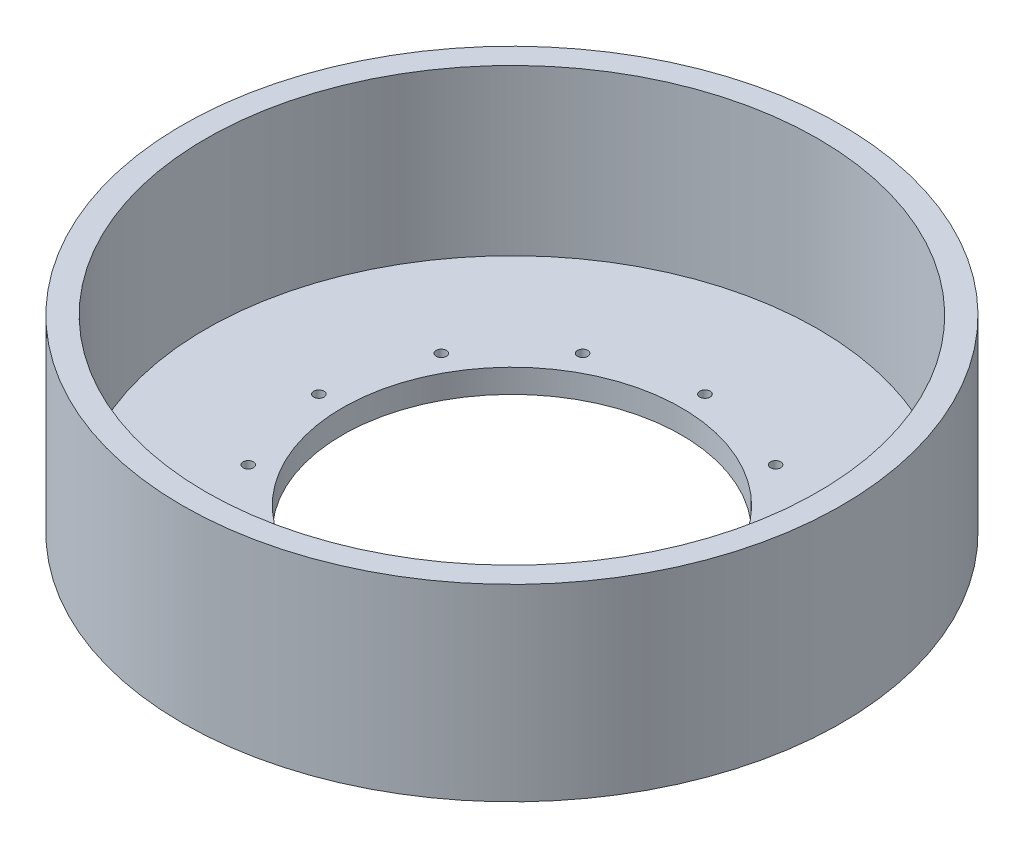
ISO-10303-21;
HEADER;
FILE_DESCRIPTION(('STEP AP214'),'2;1');
FILE_NAME('part.step','',(''),(''),'','','');
FILE_SCHEMA(('AUTOMOTIVE_DESIGN { 1 0 10303 214 1 1 1 1 }'));
ENDSEC;
DATA;
#1=APPLICATION_CONTEXT('core data for automotive mechanical design processes');
#2=APPLICATION_PROTOCOL_DEFINITION('international standard','automotive_design',2000,#1);
#3=PRODUCT_CONTEXT('',#1,'mechanical');
#4=PRODUCT('Part','Part','',(#3));
#5=PRODUCT_RELATED_PRODUCT_CATEGORY('part','',(#4));
#6=PRODUCT_DEFINITION_FORMATION('','',#4);
#7=PRODUCT_DEFINITION_CONTEXT('part definition',#1,'design');
#8=PRODUCT_DEFINITION('design','',#6,#7);
#9=PRODUCT_DEFINITION_SHAPE('','',#8);
#10=(LENGTH_UNIT() NAMED_UNIT(*) SI_UNIT(.MILLI.,.METRE.));
#11=(NAMED_UNIT(*) PLANE_ANGLE_UNIT() SI_UNIT($,.RADIAN.));
#12=(NAMED_UNIT(*) SI_UNIT($,.STERADIAN.) SOLID_ANGLE_UNIT());
#13=UNCERTAINTY_MEASURE_WITH_UNIT(LENGTH_MEASURE(1.E-05),#10,'distance_accuracy_value','');
#14=(GEOMETRIC_REPRESENTATION_CONTEXT(3) GLOBAL_UNCERTAINTY_ASSIGNED_CONTEXT((#13)) GLOBAL_UNIT_ASSIGNED_CONTEXT((#10,
#11,#12)) REPRESENTATION_CONTEXT('',''));
#15=CARTESIAN_POINT('',(0.,0.,0.));
#16=DIRECTION('',(0.,0.,1.));
#17=DIRECTION('',(1.,0.,0.));
#18=AXIS2_PLACEMENT_3D('',#15,#16,#17);
#19=CARTESIAN_POINT('',(0.,50.8,0.));
#20=DIRECTION('',(0.,-1.,0.));
#21=DIRECTION('',(0.,0.,-1.));
#22=AXIS2_PLACEMENT_3D('',#19,#20,#21);
#23=CYLINDRICAL_SURFACE('',#22,88.9);
#24=CARTESIAN_POINT('',(0.,50.8,0.));
#25=DIRECTION('',(0.,1.,0.));
#26=DIRECTION('',(0.,0.,1.));
#27=AXIS2_PLACEMENT_3D('',#24,#25,#26);
#28=CIRCLE('',#27,88.9);
#29=CARTESIAN_POINT('',(0.,50.8,88.9));
#30=VERTEX_POINT('',#29);
#31=EDGE_CURVE('E10',#30,#30,#28,.T.);
#32=ORIENTED_EDGE('',*,*,#31,.F.);
#33=EDGE_LOOP('',(#32));
#34=FACE_BOUND('',#33,.T.);
#35=CARTESIAN_POINT('',(0.,0.,0.));
#36=DIRECTION('',(0.,1.,0.));
#37=DIRECTION('',(0.,0.,1.));
#38=AXIS2_PLACEMENT_3D('',#35,#36,#37);
#39=CIRCLE('',#38,88.9);
#40=CARTESIAN_POINT('',(0.,0.,88.9));
#41=VERTEX_POINT('',#40);
#42=EDGE_CURVE('E34',#41,#41,#39,.T.);
#43=ORIENTED_EDGE('',*,*,#42,.T.);
#44=EDGE_LOOP('',(#43));
#45=FACE_BOUND('',#44,.T.);
#46=ADVANCED_FACE('F31',(#34,#45),#23,.T.);
#47=CARTESIAN_POINT('',(0.,50.8,0.));
#48=DIRECTION('',(0.,1.,0.));
#49=DIRECTION('',(0.,0.,1.));
#50=AXIS2_PLACEMENT_3D('',#47,#48,#49);
#51=PLANE('',#50);
#52=CARTESIAN_POINT('',(0.,50.8,0.));
#53=DIRECTION('',(0.,1.,0.));
#54=DIRECTION('',(0.,0.,1.));
#55=AXIS2_PLACEMENT_3D('',#52,#53,#54);
#56=CIRCLE('',#55,82.55);
#57=CARTESIAN_POINT('',(0.,50.8,82.55));
#58=VERTEX_POINT('',#57);
#59=EDGE_CURVE('E43',#58,#58,#56,.T.);
#60=ORIENTED_EDGE('',*,*,#59,.F.);
#61=EDGE_LOOP('',(#60));
#62=FACE_BOUND('',#61,.T.);
#63=ORIENTED_EDGE('',*,*,#31,.T.);
#64=EDGE_LOOP('',(#63));
#65=FACE_BOUND('',#64,.T.);
#66=ADVANCED_FACE('F158',(#62,#65),#51,.T.);
#67=CARTESIAN_POINT('',(0.,0.,0.));
#68=DIRECTION('',(0.,1.,0.));
#69=DIRECTION('',(0.,0.,1.));
#70=AXIS2_PLACEMENT_3D('',#67,#68,#69);
#71=PLANE('',#70);
#72=CARTESIAN_POINT('',(0.,0.,-52.07));
#73=DIRECTION('',(0.,1.,0.));
#74=DIRECTION('',(0.,0.,1.));
#75=AXIS2_PLACEMENT_3D('',#72,#73,#74);
#76=CIRCLE('',#75,1.397);
#77=CARTESIAN_POINT('',(0.,0.,-50.673));
#78=VERTEX_POINT('',#77);
#79=EDGE_CURVE('E52',#78,#78,#76,.T.);
#80=ORIENTED_EDGE('',*,*,#79,.T.);
#81=EDGE_LOOP('',(#80));
#82=FACE_BOUND('',#81,.T.);
#83=CARTESIAN_POINT('',(26.035,0.,-45.0939427750557));
#84=DIRECTION('',(0.,1.,0.));
#85=DIRECTION('',(0.,0.,1.));
#86=AXIS2_PLACEMENT_3D('',#83,#84,#85);
#87=CIRCLE('',#86,1.397);
#88=CARTESIAN_POINT('',(26.035,0.,-43.6969427750557));
#89=VERTEX_POINT('',#88);
#90=EDGE_CURVE('E95',#89,#89,#87,.T.);
#91=ORIENTED_EDGE('',*,*,#90,.T.);
#92=EDGE_LOOP('',(#91));
#93=FACE_BOUND('',#92,.T.);
#94=CARTESIAN_POINT('',(45.0939427750568,0.,-26.0350000000019));
#95=DIRECTION('',(0.,1.,0.));
#96=DIRECTION('',(0.,0.,1.));
#97=AXIS2_PLACEMENT_3D('',#94,#95,#96);
#98=CIRCLE('',#97,1.39700000000062);
#99=CARTESIAN_POINT('',(45.0939427750568,0.,-24.6380000000013));
#100=VERTEX_POINT('',#99);
#101=EDGE_CURVE('E89',#100,#100,#98,.T.);
#102=ORIENTED_EDGE('',*,*,#101,.T.);
#103=EDGE_LOOP('',(#102));
#104=FACE_BOUND('',#103,.T.);
#105=CARTESIAN_POINT('',(52.0700000000022,0.,-2.21350087917854E-12));
#106=DIRECTION('',(0.,1.,0.));
#107=DIRECTION('',(0.,0.,1.));
#108=AXIS2_PLACEMENT_3D('',#105,#106,#107);
#109=CIRCLE('',#108,1.39700000000164);
#110=CARTESIAN_POINT('',(52.0700000000022,0.,1.39699999999943));
#111=VERTEX_POINT('',#110);
#112=EDGE_CURVE('E83',#111,#111,#109,.T.);
#113=ORIENTED_EDGE('',*,*,#112,.T.);
#114=EDGE_LOOP('',(#113));
#115=FACE_BOUND('',#114,.T.);
#116=CARTESIAN_POINT('',(45.093942775059,0.,26.0349999999981));
#117=DIRECTION('',(0.,1.,0.));
#118=DIRECTION('',(0.,0.,1.));
#119=AXIS2_PLACEMENT_3D('',#116,#117,#118);
#120=CIRCLE('',#119,1.39700000000286);
#121=CARTESIAN_POINT('',(45.093942775059,0.,27.4320000000009));
#122=VERTEX_POINT('',#121);
#123=EDGE_CURVE('E77',#122,#122,#120,.T.);
#124=ORIENTED_EDGE('',*,*,#123,.T.);
#125=EDGE_LOOP('',(#124));
#126=FACE_BOUND('',#125,.T.);
#127=CARTESIAN_POINT('',(26.0350000000041,0.,45.0939427750546));
#128=DIRECTION('',(0.,1.,0.));
#129=DIRECTION('',(0.,0.,1.));
#130=AXIS2_PLACEMENT_3D('',#127,#128,#129);
#131=CIRCLE('',#130,1.39700000000393);
#132=CARTESIAN_POINT('',(26.0350000000041,0.,46.4909427750585));
#133=VERTEX_POINT('',#132);
#134=EDGE_CURVE('E71',#133,#133,#131,.T.);
#135=ORIENTED_EDGE('',*,*,#134,.T.);
#136=EDGE_LOOP('',(#135));
#137=FACE_BOUND('',#136,.T.);
#138=CARTESIAN_POINT('',(4.42700175835709E-12,0.,52.07));
#139=DIRECTION('',(0.,1.,0.));
#140=DIRECTION('',(0.,0.,1.));
#141=AXIS2_PLACEMENT_3D('',#138,#139,#140);
#142=CIRCLE('',#141,1.39700000000458);
#143=CARTESIAN_POINT('',(4.42700175835709E-12,0.,53.4670000000046));
#144=VERTEX_POINT('',#143);
#145=EDGE_CURVE('E65',#144,#144,#142,.T.);
#146=ORIENTED_EDGE('',*,*,#145,.T.);
#147=EDGE_LOOP('',(#146));
#148=FACE_BOUND('',#147,.T.);
#149=CARTESIAN_POINT('',(-26.0349999999959,0.,45.0939427750568));
#150=DIRECTION('',(0.,1.,0.));
#151=DIRECTION('',(0.,0.,1.));
#152=AXIS2_PLACEMENT_3D('',#149,#150,#151);
#153=CIRCLE('',#152,1.39700000000469);
#154=CARTESIAN_POINT('',(-26.0349999999959,0.,46.4909427750615));
#155=VERTEX_POINT('',#154);
#156=EDGE_CURVE('E58',#155,#155,#153,.T.);
#157=ORIENTED_EDGE('',*,*,#156,.T.);
#158=EDGE_LOOP('',(#157));
#159=FACE_BOUND('',#158,.T.);
#160=CARTESIAN_POINT('',(-45.0939427750524,0.,26.0350000000019));
#161=DIRECTION('',(0.,1.,0.));
#162=DIRECTION('',(0.,0.,1.));
#163=AXIS2_PLACEMENT_3D('',#160,#161,#162);
#164=CIRCLE('',#163,1.39700000000423);
#165=CARTESIAN_POINT('',(-45.0939427750524,0.,27.4320000000062));
#166=VERTEX_POINT('',#165);
#167=EDGE_CURVE('E59',#166,#166,#164,.T.);
#168=ORIENTED_EDGE('',*,*,#167,.T.);
#169=EDGE_LOOP('',(#168));
#170=FACE_BOUND('',#169,.T.);
#171=CARTESIAN_POINT('',(-52.0699999999978,0.,2.2198776150617E-12));
#172=DIRECTION('',(0.,1.,0.));
#173=DIRECTION('',(0.,0.,1.));
#174=AXIS2_PLACEMENT_3D('',#171,#172,#173);
#175=CIRCLE('',#174,1.39700000000329);
#176=CARTESIAN_POINT('',(-52.0699999999978,0.,1.39700000000551));
#177=VERTEX_POINT('',#176);
#178=EDGE_CURVE('E118',#177,#177,#175,.T.);
#179=ORIENTED_EDGE('',*,*,#178,.T.);
#180=EDGE_LOOP('',(#179));
#181=FACE_BOUND('',#180,.T.);
#182=CARTESIAN_POINT('',(-45.0939427750546,0.,-26.034999999998));
#183=DIRECTION('',(0.,1.,0.));
#184=DIRECTION('',(0.,0.,1.));
#185=AXIS2_PLACEMENT_3D('',#182,#183,#184);
#186=CIRCLE('',#185,1.39700000000223);
#187=CARTESIAN_POINT('',(-45.0939427750546,0.,-24.6379999999958));
#188=VERTEX_POINT('',#187);
#189=EDGE_CURVE('E112',#188,#188,#186,.T.);
#190=ORIENTED_EDGE('',*,*,#189,.T.);
#191=EDGE_LOOP('',(#190));
#192=FACE_BOUND('',#191,.T.);
#193=CARTESIAN_POINT('',(-26.0349999999997,0.,-45.0939427750546));
#194=DIRECTION('',(0.,1.,0.));
#195=DIRECTION('',(0.,0.,1.));
#196=AXIS2_PLACEMENT_3D('',#193,#194,#195);
#197=CIRCLE('',#196,1.39700000000127);
#198=CARTESIAN_POINT('',(-26.0349999999997,0.,-43.6969427750533));
#199=VERTEX_POINT('',#198);
#200=EDGE_CURVE('E106',#199,#199,#197,.T.);
#201=ORIENTED_EDGE('',*,*,#200,.T.);
#202=EDGE_LOOP('',(#201));
#203=FACE_BOUND('',#202,.T.);
#204=CARTESIAN_POINT('',(0.,0.,0.));
#205=DIRECTION('',(0.,1.,0.));
#206=DIRECTION('',(0.,0.,1.));
#207=AXIS2_PLACEMENT_3D('',#204,#205,#206);
#208=CIRCLE('',#207,45.72);
#209=CARTESIAN_POINT('',(0.,0.,45.72));
#210=VERTEX_POINT('',#209);
#211=EDGE_CURVE('E46',#210,#210,#208,.T.);
#212=ORIENTED_EDGE('',*,*,#211,.T.);
#213=EDGE_LOOP('',(#212));
#214=FACE_BOUND('',#213,.T.);
#215=ORIENTED_EDGE('',*,*,#42,.F.);
#216=EDGE_LOOP('',(#215));
#217=FACE_BOUND('',#216,.T.);
#218=ADVANCED_FACE('F127',(#82,#93,#104,#115,#126,#137,#148,#159,#170,#181,#192,#203,#214,#217),
#71,.F.);
#219=CARTESIAN_POINT('',(0.,6.35,0.));
#220=DIRECTION('',(0.,1.,0.));
#221=DIRECTION('',(0.,0.,1.));
#222=AXIS2_PLACEMENT_3D('',#219,#220,#221);
#223=CYLINDRICAL_SURFACE('',#222,82.55);
#224=CARTESIAN_POINT('',(0.,6.35,0.));
#225=DIRECTION('',(0.,1.,0.));
#226=DIRECTION('',(0.,0.,1.));
#227=AXIS2_PLACEMENT_3D('',#224,#225,#226);
#228=CIRCLE('',#227,82.55);
#229=CARTESIAN_POINT('',(0.,6.35,82.55));
#230=VERTEX_POINT('',#229);
#231=EDGE_CURVE('E41',#230,#230,#228,.T.);
#232=ORIENTED_EDGE('',*,*,#231,.F.);
#233=EDGE_LOOP('',(#232));
#234=FACE_BOUND('',#233,.T.);
#235=ORIENTED_EDGE('',*,*,#59,.T.);
#236=EDGE_LOOP('',(#235));
#237=FACE_BOUND('',#236,.T.);
#238=ADVANCED_FACE('F142',(#234,#237),#223,.F.);
#239=CARTESIAN_POINT('',(0.,6.35,0.));
#240=DIRECTION('',(0.,1.,0.));
#241=DIRECTION('',(0.,0.,1.));
#242=AXIS2_PLACEMENT_3D('',#239,#240,#241);
#243=PLANE('',#242);
#244=CARTESIAN_POINT('',(0.,6.35,0.));
#245=DIRECTION('',(0.,1.,0.));
#246=DIRECTION('',(0.,0.,1.));
#247=AXIS2_PLACEMENT_3D('',#244,#245,#246);
#248=CIRCLE('',#247,45.72);
#249=CARTESIAN_POINT('',(0.,6.35,45.72));
#250=VERTEX_POINT('',#249);
#251=EDGE_CURVE('E49',#250,#250,#248,.T.);
#252=ORIENTED_EDGE('',*,*,#251,.F.);
#253=EDGE_LOOP('',(#252));
#254=FACE_BOUND('',#253,.T.);
#255=CARTESIAN_POINT('',(0.,6.35,-52.07));
#256=DIRECTION('',(0.,1.,0.));
#257=DIRECTION('',(0.,0.,1.));
#258=AXIS2_PLACEMENT_3D('',#255,#256,#257);
#259=CIRCLE('',#258,1.397);
#260=CARTESIAN_POINT('',(0.,6.35,-50.673));
#261=VERTEX_POINT('',#260);
#262=EDGE_CURVE('E98',#261,#261,#259,.T.);
#263=ORIENTED_EDGE('',*,*,#262,.F.);
#264=EDGE_LOOP('',(#263));
#265=FACE_BOUND('',#264,.T.);
#266=CARTESIAN_POINT('',(26.035,6.35,-45.0939427750557));
#267=DIRECTION('',(0.,1.,0.));
#268=DIRECTION('',(0.,0.,1.));
#269=AXIS2_PLACEMENT_3D('',#266,#267,#268);
#270=CIRCLE('',#269,1.397);
#271=CARTESIAN_POINT('',(26.035,6.35,-43.6969427750557));
#272=VERTEX_POINT('',#271);
#273=EDGE_CURVE('E92',#272,#272,#270,.T.);
#274=ORIENTED_EDGE('',*,*,#273,.F.);
#275=EDGE_LOOP('',(#274));
#276=FACE_BOUND('',#275,.T.);
#277=CARTESIAN_POINT('',(45.0939427750568,6.35,-26.0350000000019));
#278=DIRECTION('',(0.,1.,0.));
#279=DIRECTION('',(0.,0.,1.));
#280=AXIS2_PLACEMENT_3D('',#277,#278,#279);
#281=CIRCLE('',#280,1.39700000000062);
#282=CARTESIAN_POINT('',(45.0939427750568,6.35,-24.6380000000013));
#283=VERTEX_POINT('',#282);
#284=EDGE_CURVE('E86',#283,#283,#281,.T.);
#285=ORIENTED_EDGE('',*,*,#284,.F.);
#286=EDGE_LOOP('',(#285));
#287=FACE_BOUND('',#286,.T.);
#288=CARTESIAN_POINT('',(52.0700000000022,6.35,-2.21350087917854E-12));
#289=DIRECTION('',(0.,1.,0.));
#290=DIRECTION('',(0.,0.,1.));
#291=AXIS2_PLACEMENT_3D('',#288,#289,#290);
#292=CIRCLE('',#291,1.39700000000164);
#293=CARTESIAN_POINT('',(52.0700000000022,6.35,1.39699999999943));
#294=VERTEX_POINT('',#293);
#295=EDGE_CURVE('E80',#294,#294,#292,.T.);
#296=ORIENTED_EDGE('',*,*,#295,.F.);
#297=EDGE_LOOP('',(#296));
#298=FACE_BOUND('',#297,.T.);
#299=CARTESIAN_POINT('',(45.093942775059,6.35,26.0349999999981));
#300=DIRECTION('',(0.,1.,0.));
#301=DIRECTION('',(0.,0.,1.));
#302=AXIS2_PLACEMENT_3D('',#299,#300,#301);
#303=CIRCLE('',#302,1.39700000000286);
#304=CARTESIAN_POINT('',(45.093942775059,6.35,27.4320000000009));
#305=VERTEX_POINT('',#304);
#306=EDGE_CURVE('E74',#305,#305,#303,.T.);
#307=ORIENTED_EDGE('',*,*,#306,.F.);
#308=EDGE_LOOP('',(#307));
#309=FACE_BOUND('',#308,.T.);
#310=CARTESIAN_POINT('',(26.0350000000041,6.35,45.0939427750546));
#311=DIRECTION('',(0.,1.,0.));
#312=DIRECTION('',(0.,0.,1.));
#313=AXIS2_PLACEMENT_3D('',#310,#311,#312);
#314=CIRCLE('',#313,1.39700000000393);
#315=CARTESIAN_POINT('',(26.0350000000041,6.35,46.4909427750585));
#316=VERTEX_POINT('',#315);
#317=EDGE_CURVE('E68',#316,#316,#314,.T.);
#318=ORIENTED_EDGE('',*,*,#317,.F.);
#319=EDGE_LOOP('',(#318));
#320=FACE_BOUND('',#319,.T.);
#321=CARTESIAN_POINT('',(4.42700175835709E-12,6.35,52.07));
#322=DIRECTION('',(0.,1.,0.));
#323=DIRECTION('',(0.,0.,1.));
#324=AXIS2_PLACEMENT_3D('',#321,#322,#323);
#325=CIRCLE('',#324,1.39700000000458);
#326=CARTESIAN_POINT('',(4.42700175835709E-12,6.35,53.4670000000046));
#327=VERTEX_POINT('',#326);
#328=EDGE_CURVE('E62',#327,#327,#325,.T.);
#329=ORIENTED_EDGE('',*,*,#328,.F.);
#330=EDGE_LOOP('',(#329));
#331=FACE_BOUND('',#330,.T.);
#332=CARTESIAN_POINT('',(-26.0349999999959,6.35,45.0939427750568));
#333=DIRECTION('',(0.,1.,0.));
#334=DIRECTION('',(0.,0.,1.));
#335=AXIS2_PLACEMENT_3D('',#332,#333,#334);
#336=CIRCLE('',#335,1.39700000000469);
#337=CARTESIAN_POINT('',(-26.0349999999959,6.35,46.4909427750615));
#338=VERTEX_POINT('',#337);
#339=EDGE_CURVE('E55',#338,#338,#336,.T.);
#340=ORIENTED_EDGE('',*,*,#339,.F.);
#341=EDGE_LOOP('',(#340));
#342=FACE_BOUND('',#341,.T.);
#343=CARTESIAN_POINT('',(-45.0939427750524,6.35,26.0350000000019));
#344=DIRECTION('',(0.,1.,0.));
#345=DIRECTION('',(0.,0.,1.));
#346=AXIS2_PLACEMENT_3D('',#343,#344,#345);
#347=CIRCLE('',#346,1.39700000000423);
#348=CARTESIAN_POINT('',(-45.0939427750524,6.35,27.4320000000062));
#349=VERTEX_POINT('',#348);
#350=EDGE_CURVE('E121',#349,#349,#347,.T.);
#351=ORIENTED_EDGE('',*,*,#350,.F.);
#352=EDGE_LOOP('',(#351));
#353=FACE_BOUND('',#352,.T.);
#354=CARTESIAN_POINT('',(-52.0699999999978,6.35,2.2198776150617E-12));
#355=DIRECTION('',(0.,1.,0.));
#356=DIRECTION('',(0.,0.,1.));
#357=AXIS2_PLACEMENT_3D('',#354,#355,#356);
#358=CIRCLE('',#357,1.39700000000329);
#359=CARTESIAN_POINT('',(-52.0699999999978,6.35,1.39700000000551));
#360=VERTEX_POINT('',#359);
#361=EDGE_CURVE('E115',#360,#360,#358,.T.);
#362=ORIENTED_EDGE('',*,*,#361,.F.);
#363=EDGE_LOOP('',(#362));
#364=FACE_BOUND('',#363,.T.);
#365=CARTESIAN_POINT('',(-45.0939427750546,6.35,-26.034999999998));
#366=DIRECTION('',(0.,1.,0.));
#367=DIRECTION('',(0.,0.,1.));
#368=AXIS2_PLACEMENT_3D('',#365,#366,#367);
#369=CIRCLE('',#368,1.39700000000223);
#370=CARTESIAN_POINT('',(-45.0939427750546,6.35,-24.6379999999958));
#371=VERTEX_POINT('',#370);
#372=EDGE_CURVE('E109',#371,#371,#369,.T.);
#373=ORIENTED_EDGE('',*,*,#372,.F.);
#374=EDGE_LOOP('',(#373));
#375=FACE_BOUND('',#374,.T.);
#376=CARTESIAN_POINT('',(-26.0349999999997,6.35,-45.0939427750546));
#377=DIRECTION('',(0.,1.,0.));
#378=DIRECTION('',(0.,0.,1.));
#379=AXIS2_PLACEMENT_3D('',#376,#377,#378);
#380=CIRCLE('',#379,1.39700000000127);
#381=CARTESIAN_POINT('',(-26.0349999999997,6.35,-43.6969427750533));
#382=VERTEX_POINT('',#381);
#383=EDGE_CURVE('E103',#382,#382,#380,.T.);
#384=ORIENTED_EDGE('',*,*,#383,.F.);
#385=EDGE_LOOP('',(#384));
#386=FACE_BOUND('',#385,.T.);
#387=ORIENTED_EDGE('',*,*,#231,.T.);
#388=EDGE_LOOP('',(#387));
#389=FACE_BOUND('',#388,.T.);
#390=ADVANCED_FACE('F138',(#254,#265,#276,#287,#298,#309,#320,#331,#342,#353,#364,#375,#386,
#389),#243,.T.);
#391=CARTESIAN_POINT('',(-26.0349999999997,0.,-45.0939427750546));
#392=DIRECTION('',(0.,1.,0.));
#393=DIRECTION('',(0.,0.,1.));
#394=AXIS2_PLACEMENT_3D('',#391,#392,#393);
#395=CYLINDRICAL_SURFACE('',#394,1.39700000000127);
#396=ORIENTED_EDGE('',*,*,#200,.F.);
#397=EDGE_LOOP('',(#396));
#398=FACE_BOUND('',#397,.T.);
#399=ORIENTED_EDGE('',*,*,#383,.T.);
#400=EDGE_LOOP('',(#399));
#401=FACE_BOUND('',#400,.T.);
#402=ADVANCED_FACE('F141',(#398,#401),#395,.F.);
#403=CARTESIAN_POINT('',(-45.0939427750546,0.,-26.034999999998));
#404=DIRECTION('',(0.,1.,0.));
#405=DIRECTION('',(0.,0.,1.));
#406=AXIS2_PLACEMENT_3D('',#403,#404,#405);
#407=CYLINDRICAL_SURFACE('',#406,1.39700000000223);
#408=ORIENTED_EDGE('',*,*,#189,.F.);
#409=EDGE_LOOP('',(#408));
#410=FACE_BOUND('',#409,.T.);
#411=ORIENTED_EDGE('',*,*,#372,.T.);
#412=EDGE_LOOP('',(#411));
#413=FACE_BOUND('',#412,.T.);
#414=ADVANCED_FACE('F205',(#410,#413),#407,.F.);
#415=CARTESIAN_POINT('',(-52.0699999999978,0.,2.2198776150617E-12));
#416=DIRECTION('',(0.,1.,0.));
#417=DIRECTION('',(0.,0.,1.));
#418=AXIS2_PLACEMENT_3D('',#415,#416,#417);
#419=CYLINDRICAL_SURFACE('',#418,1.39700000000329);
#420=ORIENTED_EDGE('',*,*,#178,.F.);
#421=EDGE_LOOP('',(#420));
#422=FACE_BOUND('',#421,.T.);
#423=ORIENTED_EDGE('',*,*,#361,.T.);
#424=EDGE_LOOP('',(#423));
#425=FACE_BOUND('',#424,.T.);
#426=ADVANCED_FACE('F134',(#422,#425),#419,.F.);
#427=CARTESIAN_POINT('',(-45.0939427750524,0.,26.0350000000019));
#428=DIRECTION('',(0.,1.,0.));
#429=DIRECTION('',(0.,0.,1.));
#430=AXIS2_PLACEMENT_3D('',#427,#428,#429);
#431=CYLINDRICAL_SURFACE('',#430,1.39700000000423);
#432=ORIENTED_EDGE('',*,*,#167,.F.);
#433=EDGE_LOOP('',(#432));
#434=FACE_BOUND('',#433,.T.);
#435=ORIENTED_EDGE('',*,*,#350,.T.);
#436=EDGE_LOOP('',(#435));
#437=FACE_BOUND('',#436,.T.);
#438=ADVANCED_FACE('F130',(#434,#437),#431,.F.);
#439=CARTESIAN_POINT('',(-26.0349999999959,0.,45.0939427750568));
#440=DIRECTION('',(0.,1.,0.));
#441=DIRECTION('',(0.,0.,1.));
#442=AXIS2_PLACEMENT_3D('',#439,#440,#441);
#443=CYLINDRICAL_SURFACE('',#442,1.39700000000469);
#444=ORIENTED_EDGE('',*,*,#156,.F.);
#445=EDGE_LOOP('',(#444));
#446=FACE_BOUND('',#445,.T.);
#447=ORIENTED_EDGE('',*,*,#339,.T.);
#448=EDGE_LOOP('',(#447));
#449=FACE_BOUND('',#448,.T.);
#450=ADVANCED_FACE('F133',(#446,#449),#443,.F.);
#451=CARTESIAN_POINT('',(4.42700175835709E-12,0.,52.07));
#452=DIRECTION('',(0.,1.,0.));
#453=DIRECTION('',(0.,0.,1.));
#454=AXIS2_PLACEMENT_3D('',#451,#452,#453);
#455=CYLINDRICAL_SURFACE('',#454,1.39700000000458);
#456=ORIENTED_EDGE('',*,*,#145,.F.);
#457=EDGE_LOOP('',(#456));
#458=FACE_BOUND('',#457,.T.);
#459=ORIENTED_EDGE('',*,*,#328,.T.);
#460=EDGE_LOOP('',(#459));
#461=FACE_BOUND('',#460,.T.);
#462=ADVANCED_FACE('F175',(#458,#461),#455,.F.);
#463=CARTESIAN_POINT('',(26.0350000000041,0.,45.0939427750546));
#464=DIRECTION('',(0.,1.,0.));
#465=DIRECTION('',(0.,0.,1.));
#466=AXIS2_PLACEMENT_3D('',#463,#464,#465);
#467=CYLINDRICAL_SURFACE('',#466,1.39700000000393);
#468=ORIENTED_EDGE('',*,*,#134,.F.);
#469=EDGE_LOOP('',(#468));
#470=FACE_BOUND('',#469,.T.);
#471=ORIENTED_EDGE('',*,*,#317,.T.);
#472=EDGE_LOOP('',(#471));
#473=FACE_BOUND('',#472,.T.);
#474=ADVANCED_FACE('F179',(#470,#473),#467,.F.);
#475=CARTESIAN_POINT('',(45.093942775059,0.,26.0349999999981));
#476=DIRECTION('',(0.,1.,0.));
#477=DIRECTION('',(0.,0.,1.));
#478=AXIS2_PLACEMENT_3D('',#475,#476,#477);
#479=CYLINDRICAL_SURFACE('',#478,1.39700000000286);
#480=ORIENTED_EDGE('',*,*,#123,.F.);
#481=EDGE_LOOP('',(#480));
#482=FACE_BOUND('',#481,.T.);
#483=ORIENTED_EDGE('',*,*,#306,.T.);
#484=EDGE_LOOP('',(#483));
#485=FACE_BOUND('',#484,.T.);
#486=ADVANCED_FACE('F183',(#482,#485),#479,.F.);
#487=CARTESIAN_POINT('',(52.0700000000022,0.,-2.21350087917854E-12));
#488=DIRECTION('',(0.,1.,0.));
#489=DIRECTION('',(0.,0.,1.));
#490=AXIS2_PLACEMENT_3D('',#487,#488,#489);
#491=CYLINDRICAL_SURFACE('',#490,1.39700000000164);
#492=ORIENTED_EDGE('',*,*,#112,.F.);
#493=EDGE_LOOP('',(#492));
#494=FACE_BOUND('',#493,.T.);
#495=ORIENTED_EDGE('',*,*,#295,.T.);
#496=EDGE_LOOP('',(#495));
#497=FACE_BOUND('',#496,.T.);
#498=ADVANCED_FACE('F187',(#494,#497),#491,.F.);
#499=CARTESIAN_POINT('',(45.0939427750568,0.,-26.0350000000019));
#500=DIRECTION('',(0.,1.,0.));
#501=DIRECTION('',(0.,0.,1.));
#502=AXIS2_PLACEMENT_3D('',#499,#500,#501);
#503=CYLINDRICAL_SURFACE('',#502,1.39700000000062);
#504=ORIENTED_EDGE('',*,*,#101,.F.);
#505=EDGE_LOOP('',(#504));
#506=FACE_BOUND('',#505,.T.);
#507=ORIENTED_EDGE('',*,*,#284,.T.);
#508=EDGE_LOOP('',(#507));
#509=FACE_BOUND('',#508,.T.);
#510=ADVANCED_FACE('F191',(#506,#509),#503,.F.);
#511=CARTESIAN_POINT('',(26.035,0.,-45.0939427750557));
#512=DIRECTION('',(0.,1.,0.));
#513=DIRECTION('',(0.,0.,1.));
#514=AXIS2_PLACEMENT_3D('',#511,#512,#513);
#515=CYLINDRICAL_SURFACE('',#514,1.397);
#516=ORIENTED_EDGE('',*,*,#90,.F.);
#517=EDGE_LOOP('',(#516));
#518=FACE_BOUND('',#517,.T.);
#519=ORIENTED_EDGE('',*,*,#273,.T.);
#520=EDGE_LOOP('',(#519));
#521=FACE_BOUND('',#520,.T.);
#522=ADVANCED_FACE('F195',(#518,#521),#515,.F.);
#523=CARTESIAN_POINT('',(0.,0.,-52.07));
#524=DIRECTION('',(0.,1.,0.));
#525=DIRECTION('',(0.,0.,1.));
#526=AXIS2_PLACEMENT_3D('',#523,#524,#525);
#527=CYLINDRICAL_SURFACE('',#526,1.397);
#528=ORIENTED_EDGE('',*,*,#79,.F.);
#529=EDGE_LOOP('',(#528));
#530=FACE_BOUND('',#529,.T.);
#531=ORIENTED_EDGE('',*,*,#262,.T.);
#532=EDGE_LOOP('',(#531));
#533=FACE_BOUND('',#532,.T.);
#534=ADVANCED_FACE('F171',(#530,#533),#527,.F.);
#535=CARTESIAN_POINT('',(0.,0.,0.));
#536=DIRECTION('',(0.,1.,0.));
#537=DIRECTION('',(0.,0.,1.));
#538=AXIS2_PLACEMENT_3D('',#535,#536,#537);
#539=CYLINDRICAL_SURFACE('',#538,45.72);
#540=ORIENTED_EDGE('',*,*,#211,.F.);
#541=EDGE_LOOP('',(#540));
#542=FACE_BOUND('',#541,.T.);
#543=ORIENTED_EDGE('',*,*,#251,.T.);
#544=EDGE_LOOP('',(#543));
#545=FACE_BOUND('',#544,.T.);
#546=ADVANCED_FACE('F168',(#542,#545),#539,.F.);
#547=CLOSED_SHELL('',(#46,#66,#218,#238,#390,#402,#414,#426,#438,#450,#462,#474,#486,#498,#510,
#522,#534,#546));
#548=MANIFOLD_SOLID_BREP('B2',#547);
#549=ADVANCED_BREP_SHAPE_REPRESENTATION('',(#18,#548),#14);
#550=SHAPE_DEFINITION_REPRESENTATION(#9,#549);
ENDSEC;
END-ISO-10303-21;
